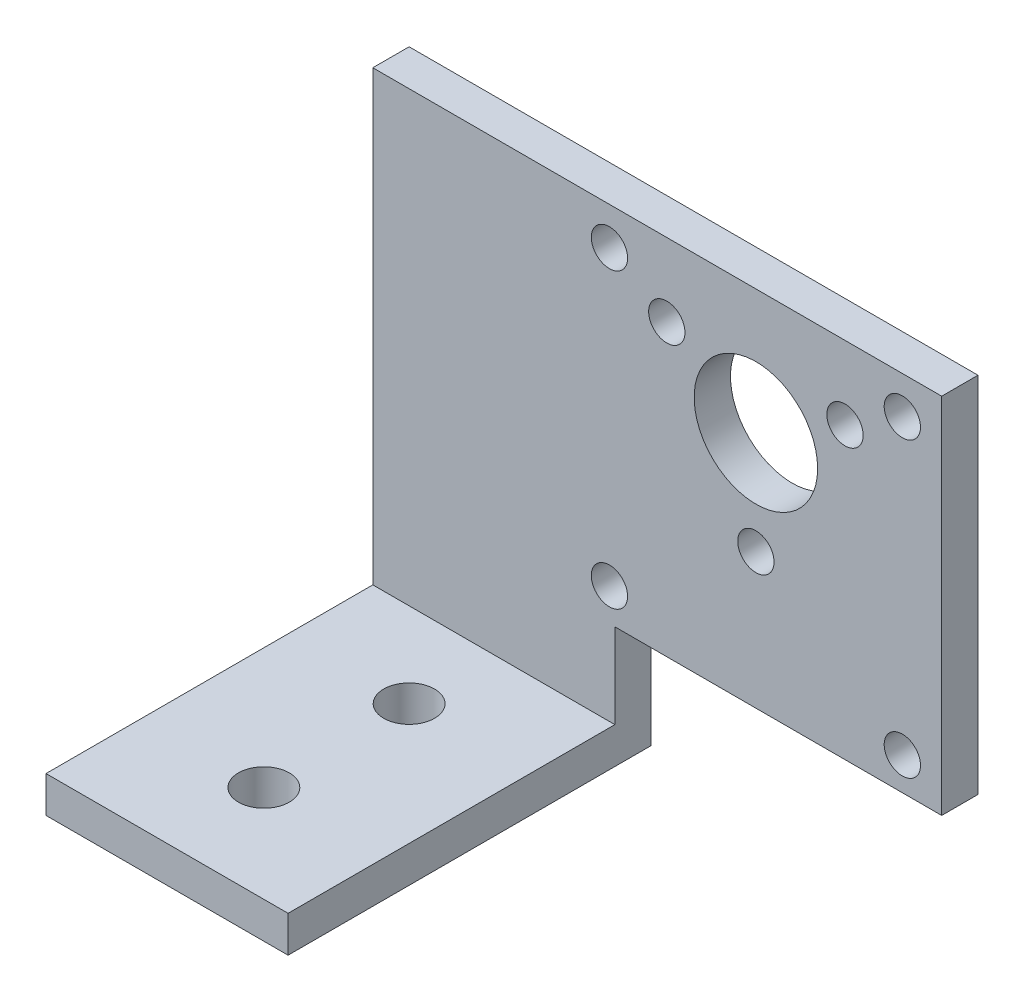
ISO-10303-21;
HEADER;
FILE_DESCRIPTION(('STEP AP214'),'2;1');
FILE_NAME('part.step','',(''),(''),'','','');
FILE_SCHEMA(('AUTOMOTIVE_DESIGN { 1 0 10303 214 1 1 1 1 }'));
ENDSEC;
DATA;
#1=APPLICATION_CONTEXT('core data for automotive mechanical design processes');
#2=APPLICATION_PROTOCOL_DEFINITION('international standard','automotive_design',2000,#1);
#3=PRODUCT_CONTEXT('',#1,'mechanical');
#4=PRODUCT('Part','Part','',(#3));
#5=PRODUCT_RELATED_PRODUCT_CATEGORY('part','',(#4));
#6=PRODUCT_DEFINITION_FORMATION('','',#4);
#7=PRODUCT_DEFINITION_CONTEXT('part definition',#1,'design');
#8=PRODUCT_DEFINITION('design','',#6,#7);
#9=PRODUCT_DEFINITION_SHAPE('','',#8);
#10=(LENGTH_UNIT() NAMED_UNIT(*) SI_UNIT(.MILLI.,.METRE.));
#11=(NAMED_UNIT(*) PLANE_ANGLE_UNIT() SI_UNIT($,.RADIAN.));
#12=(NAMED_UNIT(*) SI_UNIT($,.STERADIAN.) SOLID_ANGLE_UNIT());
#13=UNCERTAINTY_MEASURE_WITH_UNIT(LENGTH_MEASURE(1.E-05),#10,'distance_accuracy_value','');
#14=(GEOMETRIC_REPRESENTATION_CONTEXT(3) GLOBAL_UNCERTAINTY_ASSIGNED_CONTEXT((#13)) GLOBAL_UNIT_ASSIGNED_CONTEXT((#10,
#11,#12)) REPRESENTATION_CONTEXT('',''));
#15=CARTESIAN_POINT('',(0.,0.,0.));
#16=DIRECTION('',(0.,0.,1.));
#17=DIRECTION('',(1.,0.,0.));
#18=AXIS2_PLACEMENT_3D('',#15,#16,#17);
#19=CARTESIAN_POINT('',(-11.65,-19.7,3.));
#20=DIRECTION('',(0.,0.,-1.));
#21=DIRECTION('',(-1.,0.,0.));
#22=AXIS2_PLACEMENT_3D('',#19,#20,#21);
#23=PLANE('',#22);
#24=CARTESIAN_POINT('',(7.36121593216771,4.25000000000004,3.));
#25=DIRECTION('',(0.,0.,1.));
#26=DIRECTION('',(1.,0.,0.));
#27=AXIS2_PLACEMENT_3D('',#24,#25,#26);
#28=CIRCLE('',#27,1.5);
#29=CARTESIAN_POINT('',(8.86121593216771,4.25000000000004,3.));
#30=VERTEX_POINT('',#29);
#31=EDGE_CURVE('E131',#30,#30,#28,.T.);
#32=ORIENTED_EDGE('',*,*,#31,.F.);
#33=EDGE_LOOP('',(#32));
#34=FACE_BOUND('',#33,.T.);
#35=CARTESIAN_POINT('',(0.,-8.5,3.));
#36=DIRECTION('',(0.,0.,1.));
#37=DIRECTION('',(1.,0.,0.));
#38=AXIS2_PLACEMENT_3D('',#35,#36,#37);
#39=CIRCLE('',#38,1.5);
#40=CARTESIAN_POINT('',(1.5,-8.5,3.));
#41=VERTEX_POINT('',#40);
#42=EDGE_CURVE('E143',#41,#41,#39,.T.);
#43=ORIENTED_EDGE('',*,*,#42,.F.);
#44=EDGE_LOOP('',(#43));
#45=FACE_BOUND('',#44,.T.);
#46=CARTESIAN_POINT('',(12.1,-17.,3.));
#47=DIRECTION('',(0.,0.,1.));
#48=DIRECTION('',(1.,0.,0.));
#49=AXIS2_PLACEMENT_3D('',#46,#47,#48);
#50=CIRCLE('',#49,1.5);
#51=CARTESIAN_POINT('',(13.6,-17.,3.));
#52=VERTEX_POINT('',#51);
#53=EDGE_CURVE('E155',#52,#52,#50,.T.);
#54=ORIENTED_EDGE('',*,*,#53,.F.);
#55=EDGE_LOOP('',(#54));
#56=FACE_BOUND('',#55,.T.);
#57=CARTESIAN_POINT('',(-12.1,7.2,3.));
#58=DIRECTION('',(0.,0.,1.));
#59=DIRECTION('',(1.,0.,0.));
#60=AXIS2_PLACEMENT_3D('',#57,#58,#59);
#61=CIRCLE('',#60,1.5);
#62=CARTESIAN_POINT('',(-10.6,7.2,3.));
#63=VERTEX_POINT('',#62);
#64=EDGE_CURVE('E167',#63,#63,#61,.T.);
#65=ORIENTED_EDGE('',*,*,#64,.F.);
#66=EDGE_LOOP('',(#65));
#67=FACE_BOUND('',#66,.T.);
#68=CARTESIAN_POINT('',(0.,0.,3.));
#69=DIRECTION('',(0.,0.,1.));
#70=DIRECTION('',(1.,0.,0.));
#71=AXIS2_PLACEMENT_3D('',#68,#69,#70);
#72=CIRCLE('',#71,5.1);
#73=CARTESIAN_POINT('',(5.1,0.,3.));
#74=VERTEX_POINT('',#73);
#75=EDGE_CURVE('E173',#74,#74,#72,.T.);
#76=ORIENTED_EDGE('',*,*,#75,.F.);
#77=EDGE_LOOP('',(#76));
#78=FACE_BOUND('',#77,.T.);
#79=CARTESIAN_POINT('',(-12.1,-17.,3.));
#80=DIRECTION('',(0.,0.,1.));
#81=DIRECTION('',(1.,0.,0.));
#82=AXIS2_PLACEMENT_3D('',#79,#80,#81);
#83=CIRCLE('',#82,1.5);
#84=CARTESIAN_POINT('',(-10.6,-17.,3.));
#85=VERTEX_POINT('',#84);
#86=EDGE_CURVE('E161',#85,#85,#83,.T.);
#87=ORIENTED_EDGE('',*,*,#86,.F.);
#88=EDGE_LOOP('',(#87));
#89=FACE_BOUND('',#88,.T.);
#90=CARTESIAN_POINT('',(12.1,7.2,3.));
#91=DIRECTION('',(0.,0.,1.));
#92=DIRECTION('',(1.,0.,0.));
#93=AXIS2_PLACEMENT_3D('',#90,#91,#92);
#94=CIRCLE('',#93,1.5);
#95=CARTESIAN_POINT('',(13.6,7.2,3.));
#96=VERTEX_POINT('',#95);
#97=EDGE_CURVE('E149',#96,#96,#94,.T.);
#98=ORIENTED_EDGE('',*,*,#97,.F.);
#99=EDGE_LOOP('',(#98));
#100=FACE_BOUND('',#99,.T.);
#101=CARTESIAN_POINT('',(-7.36121593216771,4.25000000000003,3.));
#102=DIRECTION('',(0.,0.,1.));
#103=DIRECTION('',(1.,0.,0.));
#104=AXIS2_PLACEMENT_3D('',#101,#102,#103);
#105=CIRCLE('',#104,1.5);
#106=CARTESIAN_POINT('',(-5.86121593216771,4.25000000000003,3.));
#107=VERTEX_POINT('',#106);
#108=EDGE_CURVE('E137',#107,#107,#105,.T.);
#109=ORIENTED_EDGE('',*,*,#108,.F.);
#110=EDGE_LOOP('',(#109));
#111=FACE_BOUND('',#110,.T.);
#112=DIRECTION('',(-1.,0.,0.));
#113=VECTOR('',#112,1.);
#114=CARTESIAN_POINT('',(-11.65,-26.7,3.));
#115=LINE('',#114,#113);
#116=CARTESIAN_POINT('',(-11.65,-26.7,3.));
#117=VERTEX_POINT('',#116);
#118=CARTESIAN_POINT('',(-31.65,-26.7,3.));
#119=VERTEX_POINT('',#118);
#120=EDGE_CURVE('E43',#117,#119,#115,.T.);
#121=ORIENTED_EDGE('',*,*,#120,.F.);
#122=DIRECTION('',(0.,1.,0.));
#123=VECTOR('',#122,1.);
#124=CARTESIAN_POINT('',(-11.65,-29.7,3.));
#125=LINE('',#124,#123);
#126=CARTESIAN_POINT('',(-11.65,-19.7,3.));
#127=VERTEX_POINT('',#126);
#128=EDGE_CURVE('E189',#117,#127,#125,.T.);
#129=ORIENTED_EDGE('',*,*,#128,.T.);
#130=DIRECTION('',(1.,0.,0.));
#131=VECTOR('',#130,1.);
#132=CARTESIAN_POINT('',(-11.65,-19.7,3.));
#133=LINE('',#132,#131);
#134=CARTESIAN_POINT('',(15.35,-19.7,3.));
#135=VERTEX_POINT('',#134);
#136=EDGE_CURVE('E192',#127,#135,#133,.T.);
#137=ORIENTED_EDGE('',*,*,#136,.T.);
#138=DIRECTION('',(0.,1.,0.));
#139=VECTOR('',#138,1.);
#140=CARTESIAN_POINT('',(15.35,-19.7,3.));
#141=LINE('',#140,#139);
#142=CARTESIAN_POINT('',(15.35,10.3,3.));
#143=VERTEX_POINT('',#142);
#144=EDGE_CURVE('E208',#135,#143,#141,.T.);
#145=ORIENTED_EDGE('',*,*,#144,.T.);
#146=DIRECTION('',(-1.,0.,0.));
#147=VECTOR('',#146,1.);
#148=CARTESIAN_POINT('',(15.35,10.3,3.));
#149=LINE('',#148,#147);
#150=CARTESIAN_POINT('',(-31.65,10.3,3.));
#151=VERTEX_POINT('',#150);
#152=EDGE_CURVE('E49',#143,#151,#149,.T.);
#153=ORIENTED_EDGE('',*,*,#152,.T.);
#154=DIRECTION('',(0.,-1.,0.));
#155=VECTOR('',#154,1.);
#156=CARTESIAN_POINT('',(-31.65,10.3,3.));
#157=LINE('',#156,#155);
#158=EDGE_CURVE('E90',#151,#119,#157,.T.);
#159=ORIENTED_EDGE('',*,*,#158,.T.);
#160=EDGE_LOOP('',(#121,#129,#137,#145,#153,#159));
#161=FACE_BOUND('',#160,.T.);
#162=ADVANCED_FACE('F26',(#34,#45,#56,#67,#78,#89,#100,#111,#161),#23,.F.);
#163=CARTESIAN_POINT('',(-11.65,-19.7,0.));
#164=DIRECTION('',(0.,0.,-1.));
#165=DIRECTION('',(-1.,0.,0.));
#166=AXIS2_PLACEMENT_3D('',#163,#164,#165);
#167=PLANE('',#166);
#168=CARTESIAN_POINT('',(-7.36121593216771,4.25000000000003,0.));
#169=DIRECTION('',(0.,0.,1.));
#170=DIRECTION('',(1.,0.,0.));
#171=AXIS2_PLACEMENT_3D('',#168,#169,#170);
#172=CIRCLE('',#171,1.5);
#173=CARTESIAN_POINT('',(-5.86121593216771,4.25000000000003,0.));
#174=VERTEX_POINT('',#173);
#175=EDGE_CURVE('E134',#174,#174,#172,.T.);
#176=ORIENTED_EDGE('',*,*,#175,.T.);
#177=EDGE_LOOP('',(#176));
#178=FACE_BOUND('',#177,.T.);
#179=CARTESIAN_POINT('',(12.1,7.2,0.));
#180=DIRECTION('',(0.,0.,1.));
#181=DIRECTION('',(1.,0.,0.));
#182=AXIS2_PLACEMENT_3D('',#179,#180,#181);
#183=CIRCLE('',#182,1.5);
#184=CARTESIAN_POINT('',(13.6,7.2,0.));
#185=VERTEX_POINT('',#184);
#186=EDGE_CURVE('E146',#185,#185,#183,.T.);
#187=ORIENTED_EDGE('',*,*,#186,.T.);
#188=EDGE_LOOP('',(#187));
#189=FACE_BOUND('',#188,.T.);
#190=CARTESIAN_POINT('',(-12.1,-17.,0.));
#191=DIRECTION('',(0.,0.,1.));
#192=DIRECTION('',(1.,0.,0.));
#193=AXIS2_PLACEMENT_3D('',#190,#191,#192);
#194=CIRCLE('',#193,1.5);
#195=CARTESIAN_POINT('',(-10.6,-17.,0.));
#196=VERTEX_POINT('',#195);
#197=EDGE_CURVE('E158',#196,#196,#194,.T.);
#198=ORIENTED_EDGE('',*,*,#197,.T.);
#199=EDGE_LOOP('',(#198));
#200=FACE_BOUND('',#199,.T.);
#201=CARTESIAN_POINT('',(0.,0.,0.));
#202=DIRECTION('',(0.,0.,1.));
#203=DIRECTION('',(1.,0.,0.));
#204=AXIS2_PLACEMENT_3D('',#201,#202,#203);
#205=CIRCLE('',#204,5.1);
#206=CARTESIAN_POINT('',(5.1,0.,0.));
#207=VERTEX_POINT('',#206);
#208=EDGE_CURVE('E170',#207,#207,#205,.T.);
#209=ORIENTED_EDGE('',*,*,#208,.T.);
#210=EDGE_LOOP('',(#209));
#211=FACE_BOUND('',#210,.T.);
#212=DIRECTION('',(0.,1.,0.));
#213=VECTOR('',#212,1.);
#214=CARTESIAN_POINT('',(-11.65,-29.7,0.));
#215=LINE('',#214,#213);
#216=CARTESIAN_POINT('',(-11.65,-29.7,0.));
#217=VERTEX_POINT('',#216);
#218=CARTESIAN_POINT('',(-11.65,-19.7,0.));
#219=VERTEX_POINT('',#218);
#220=EDGE_CURVE('E176',#217,#219,#215,.T.);
#221=ORIENTED_EDGE('',*,*,#220,.F.);
#222=DIRECTION('',(1.,0.,0.));
#223=VECTOR('',#222,1.);
#224=CARTESIAN_POINT('',(-31.65,-29.7,0.));
#225=LINE('',#224,#223);
#226=CARTESIAN_POINT('',(-31.65,-29.7,0.));
#227=VERTEX_POINT('',#226);
#228=EDGE_CURVE('E187',#227,#217,#225,.T.);
#229=ORIENTED_EDGE('',*,*,#228,.F.);
#230=DIRECTION('',(0.,-1.,0.));
#231=VECTOR('',#230,1.);
#232=CARTESIAN_POINT('',(-31.65,10.3,0.));
#233=LINE('',#232,#231);
#234=CARTESIAN_POINT('',(-31.65,10.3,0.));
#235=VERTEX_POINT('',#234);
#236=EDGE_CURVE('E185',#235,#227,#233,.T.);
#237=ORIENTED_EDGE('',*,*,#236,.F.);
#238=DIRECTION('',(-1.,0.,0.));
#239=VECTOR('',#238,1.);
#240=CARTESIAN_POINT('',(15.35,10.3,0.));
#241=LINE('',#240,#239);
#242=CARTESIAN_POINT('',(15.35,10.3,0.));
#243=VERTEX_POINT('',#242);
#244=EDGE_CURVE('E183',#243,#235,#241,.T.);
#245=ORIENTED_EDGE('',*,*,#244,.F.);
#246=DIRECTION('',(0.,1.,0.));
#247=VECTOR('',#246,1.);
#248=CARTESIAN_POINT('',(15.35,-19.7,0.));
#249=LINE('',#248,#247);
#250=CARTESIAN_POINT('',(15.35,-19.7,0.));
#251=VERTEX_POINT('',#250);
#252=EDGE_CURVE('E181',#251,#243,#249,.T.);
#253=ORIENTED_EDGE('',*,*,#252,.F.);
#254=DIRECTION('',(1.,0.,0.));
#255=VECTOR('',#254,1.);
#256=CARTESIAN_POINT('',(-11.65,-19.7,0.));
#257=LINE('',#256,#255);
#258=EDGE_CURVE('E179',#219,#251,#257,.T.);
#259=ORIENTED_EDGE('',*,*,#258,.F.);
#260=EDGE_LOOP('',(#221,#229,#237,#245,#253,#259));
#261=FACE_BOUND('',#260,.T.);
#262=CARTESIAN_POINT('',(-12.1,7.2,0.));
#263=DIRECTION('',(0.,0.,1.));
#264=DIRECTION('',(1.,0.,0.));
#265=AXIS2_PLACEMENT_3D('',#262,#263,#264);
#266=CIRCLE('',#265,1.5);
#267=CARTESIAN_POINT('',(-10.6,7.2,0.));
#268=VERTEX_POINT('',#267);
#269=EDGE_CURVE('E164',#268,#268,#266,.T.);
#270=ORIENTED_EDGE('',*,*,#269,.T.);
#271=EDGE_LOOP('',(#270));
#272=FACE_BOUND('',#271,.T.);
#273=CARTESIAN_POINT('',(12.1,-17.,0.));
#274=DIRECTION('',(0.,0.,1.));
#275=DIRECTION('',(1.,0.,0.));
#276=AXIS2_PLACEMENT_3D('',#273,#274,#275);
#277=CIRCLE('',#276,1.5);
#278=CARTESIAN_POINT('',(13.6,-17.,0.));
#279=VERTEX_POINT('',#278);
#280=EDGE_CURVE('E152',#279,#279,#277,.T.);
#281=ORIENTED_EDGE('',*,*,#280,.T.);
#282=EDGE_LOOP('',(#281));
#283=FACE_BOUND('',#282,.T.);
#284=CARTESIAN_POINT('',(0.,-8.5,0.));
#285=DIRECTION('',(0.,0.,1.));
#286=DIRECTION('',(1.,0.,0.));
#287=AXIS2_PLACEMENT_3D('',#284,#285,#286);
#288=CIRCLE('',#287,1.5);
#289=CARTESIAN_POINT('',(1.5,-8.5,0.));
#290=VERTEX_POINT('',#289);
#291=EDGE_CURVE('E140',#290,#290,#288,.T.);
#292=ORIENTED_EDGE('',*,*,#291,.T.);
#293=EDGE_LOOP('',(#292));
#294=FACE_BOUND('',#293,.T.);
#295=CARTESIAN_POINT('',(7.36121593216771,4.25000000000004,0.));
#296=DIRECTION('',(0.,0.,1.));
#297=DIRECTION('',(1.,0.,0.));
#298=AXIS2_PLACEMENT_3D('',#295,#296,#297);
#299=CIRCLE('',#298,1.5);
#300=CARTESIAN_POINT('',(8.86121593216771,4.25000000000004,0.));
#301=VERTEX_POINT('',#300);
#302=EDGE_CURVE('E112',#301,#301,#299,.T.);
#303=ORIENTED_EDGE('',*,*,#302,.T.);
#304=EDGE_LOOP('',(#303));
#305=FACE_BOUND('',#304,.T.);
#306=ADVANCED_FACE('F226',(#178,#189,#200,#211,#261,#272,#283,#294,#305),#167,.T.);
#307=CARTESIAN_POINT('',(-11.65,-29.7,3.));
#308=DIRECTION('',(-1.,0.,0.));
#309=DIRECTION('',(0.,0.,1.));
#310=AXIS2_PLACEMENT_3D('',#307,#308,#309);
#311=PLANE('',#310);
#312=ORIENTED_EDGE('',*,*,#220,.T.);
#313=DIRECTION('',(0.,0.,-1.));
#314=VECTOR('',#313,1.);
#315=CARTESIAN_POINT('',(-11.65,-19.7,3.));
#316=LINE('',#315,#314);
#317=EDGE_CURVE('E11',#127,#219,#316,.T.);
#318=ORIENTED_EDGE('',*,*,#317,.F.);
#319=ORIENTED_EDGE('',*,*,#128,.F.);
#320=DIRECTION('',(0.,0.,-1.));
#321=VECTOR('',#320,1.);
#322=CARTESIAN_POINT('',(-11.65,-26.7,30.));
#323=LINE('',#322,#321);
#324=CARTESIAN_POINT('',(-11.65,-26.7,30.));
#325=VERTEX_POINT('',#324);
#326=EDGE_CURVE('E103',#325,#117,#323,.T.);
#327=ORIENTED_EDGE('',*,*,#326,.F.);
#328=DIRECTION('',(0.,1.,0.));
#329=VECTOR('',#328,1.);
#330=CARTESIAN_POINT('',(-11.65,-29.7,30.));
#331=LINE('',#330,#329);
#332=CARTESIAN_POINT('',(-11.65,-29.7,30.));
#333=VERTEX_POINT('',#332);
#334=EDGE_CURVE('E104',#333,#325,#331,.T.);
#335=ORIENTED_EDGE('',*,*,#334,.F.);
#336=DIRECTION('',(0.,0.,-1.));
#337=VECTOR('',#336,1.);
#338=CARTESIAN_POINT('',(-11.65,-29.7,3.));
#339=LINE('',#338,#337);
#340=EDGE_CURVE('E94',#333,#217,#339,.T.);
#341=ORIENTED_EDGE('',*,*,#340,.T.);
#342=EDGE_LOOP('',(#312,#318,#319,#327,#335,#341));
#343=FACE_BOUND('',#342,.T.);
#344=ADVANCED_FACE('F28',(#343),#311,.F.);
#345=CARTESIAN_POINT('',(-11.65,-19.7,3.));
#346=DIRECTION('',(0.,1.,0.));
#347=DIRECTION('',(-1.,0.,0.));
#348=AXIS2_PLACEMENT_3D('',#345,#346,#347);
#349=PLANE('',#348);
#350=ORIENTED_EDGE('',*,*,#258,.T.);
#351=DIRECTION('',(0.,0.,-1.));
#352=VECTOR('',#351,1.);
#353=CARTESIAN_POINT('',(15.35,-19.7,3.));
#354=LINE('',#353,#352);
#355=EDGE_CURVE('E35',#135,#251,#354,.T.);
#356=ORIENTED_EDGE('',*,*,#355,.F.);
#357=ORIENTED_EDGE('',*,*,#136,.F.);
#358=ORIENTED_EDGE('',*,*,#317,.T.);
#359=EDGE_LOOP('',(#350,#356,#357,#358));
#360=FACE_BOUND('',#359,.T.);
#361=ADVANCED_FACE('F215',(#360),#349,.F.);
#362=CARTESIAN_POINT('',(15.35,-19.7,3.));
#363=DIRECTION('',(-1.,0.,0.));
#364=DIRECTION('',(0.,0.,1.));
#365=AXIS2_PLACEMENT_3D('',#362,#363,#364);
#366=PLANE('',#365);
#367=ORIENTED_EDGE('',*,*,#252,.T.);
#368=DIRECTION('',(0.,0.,-1.));
#369=VECTOR('',#368,1.);
#370=CARTESIAN_POINT('',(15.35,10.3,3.));
#371=LINE('',#370,#369);
#372=EDGE_CURVE('E197',#143,#243,#371,.T.);
#373=ORIENTED_EDGE('',*,*,#372,.F.);
#374=ORIENTED_EDGE('',*,*,#144,.F.);
#375=ORIENTED_EDGE('',*,*,#355,.T.);
#376=EDGE_LOOP('',(#367,#373,#374,#375));
#377=FACE_BOUND('',#376,.T.);
#378=ADVANCED_FACE('F218',(#377),#366,.F.);
#379=CARTESIAN_POINT('',(15.35,10.3,3.));
#380=DIRECTION('',(0.,-1.,0.));
#381=DIRECTION('',(1.,0.,0.));
#382=AXIS2_PLACEMENT_3D('',#379,#380,#381);
#383=PLANE('',#382);
#384=ORIENTED_EDGE('',*,*,#244,.T.);
#385=DIRECTION('',(0.,0.,-1.));
#386=VECTOR('',#385,1.);
#387=CARTESIAN_POINT('',(-31.65,10.3,3.));
#388=LINE('',#387,#386);
#389=EDGE_CURVE('E200',#151,#235,#388,.T.);
#390=ORIENTED_EDGE('',*,*,#389,.F.);
#391=ORIENTED_EDGE('',*,*,#152,.F.);
#392=ORIENTED_EDGE('',*,*,#372,.T.);
#393=EDGE_LOOP('',(#384,#390,#391,#392));
#394=FACE_BOUND('',#393,.T.);
#395=ADVANCED_FACE('F221',(#394),#383,.F.);
#396=CARTESIAN_POINT('',(-31.65,10.3,3.));
#397=DIRECTION('',(1.,0.,0.));
#398=DIRECTION('',(0.,1.,0.));
#399=AXIS2_PLACEMENT_3D('',#396,#397,#398);
#400=PLANE('',#399);
#401=ORIENTED_EDGE('',*,*,#236,.T.);
#402=DIRECTION('',(0.,0.,-1.));
#403=VECTOR('',#402,1.);
#404=CARTESIAN_POINT('',(-31.65,-29.7,3.));
#405=LINE('',#404,#403);
#406=CARTESIAN_POINT('',(-31.65,-29.7,30.));
#407=VERTEX_POINT('',#406);
#408=EDGE_CURVE('E202',#407,#227,#405,.T.);
#409=ORIENTED_EDGE('',*,*,#408,.F.);
#410=DIRECTION('',(0.,-1.,0.));
#411=VECTOR('',#410,1.);
#412=CARTESIAN_POINT('',(-31.65,-29.7,30.));
#413=LINE('',#412,#411);
#414=CARTESIAN_POINT('',(-31.65,-26.7,30.));
#415=VERTEX_POINT('',#414);
#416=EDGE_CURVE('E109',#415,#407,#413,.T.);
#417=ORIENTED_EDGE('',*,*,#416,.F.);
#418=DIRECTION('',(0.,0.,-1.));
#419=VECTOR('',#418,1.);
#420=CARTESIAN_POINT('',(-31.65,-26.7,30.));
#421=LINE('',#420,#419);
#422=EDGE_CURVE('E100',#415,#119,#421,.T.);
#423=ORIENTED_EDGE('',*,*,#422,.T.);
#424=ORIENTED_EDGE('',*,*,#158,.F.);
#425=ORIENTED_EDGE('',*,*,#389,.T.);
#426=EDGE_LOOP('',(#401,#409,#417,#423,#424,#425));
#427=FACE_BOUND('',#426,.T.);
#428=ADVANCED_FACE('F107',(#427),#400,.F.);
#429=CARTESIAN_POINT('',(-31.65,-29.7,3.));
#430=DIRECTION('',(0.,1.,0.));
#431=DIRECTION('',(-1.,0.,0.));
#432=AXIS2_PLACEMENT_3D('',#429,#430,#431);
#433=PLANE('',#432);
#434=CARTESIAN_POINT('',(-21.65,-29.7,22.));
#435=DIRECTION('',(0.,1.,0.));
#436=DIRECTION('',(0.,0.,1.));
#437=AXIS2_PLACEMENT_3D('',#434,#435,#436);
#438=CIRCLE('',#437,2.1);
#439=CARTESIAN_POINT('',(-21.65,-29.7,24.1));
#440=VERTEX_POINT('',#439);
#441=EDGE_CURVE('E315',#440,#440,#438,.T.);
#442=ORIENTED_EDGE('',*,*,#441,.T.);
#443=EDGE_LOOP('',(#442));
#444=FACE_BOUND('',#443,.T.);
#445=CARTESIAN_POINT('',(-21.65,-29.7,10.));
#446=DIRECTION('',(0.,1.,0.));
#447=DIRECTION('',(0.,0.,1.));
#448=AXIS2_PLACEMENT_3D('',#445,#446,#447);
#449=CIRCLE('',#448,2.1);
#450=CARTESIAN_POINT('',(-21.65,-29.7,12.1));
#451=VERTEX_POINT('',#450);
#452=EDGE_CURVE('E105',#451,#451,#449,.T.);
#453=ORIENTED_EDGE('',*,*,#452,.T.);
#454=EDGE_LOOP('',(#453));
#455=FACE_BOUND('',#454,.T.);
#456=ORIENTED_EDGE('',*,*,#228,.T.);
#457=ORIENTED_EDGE('',*,*,#340,.F.);
#458=DIRECTION('',(1.,0.,0.));
#459=VECTOR('',#458,1.);
#460=CARTESIAN_POINT('',(-11.65,-29.7,30.));
#461=LINE('',#460,#459);
#462=EDGE_CURVE('E110',#407,#333,#461,.T.);
#463=ORIENTED_EDGE('',*,*,#462,.F.);
#464=ORIENTED_EDGE('',*,*,#408,.T.);
#465=EDGE_LOOP('',(#456,#457,#463,#464));
#466=FACE_BOUND('',#465,.T.);
#467=ADVANCED_FACE('F229',(#444,#455,#466),#433,.F.);
#468=CARTESIAN_POINT('',(0.,0.,3.));
#469=DIRECTION('',(0.,0.,-1.));
#470=DIRECTION('',(-1.,0.,0.));
#471=AXIS2_PLACEMENT_3D('',#468,#469,#470);
#472=CYLINDRICAL_SURFACE('',#471,5.1);
#473=ORIENTED_EDGE('',*,*,#75,.T.);
#474=EDGE_LOOP('',(#473));
#475=FACE_BOUND('',#474,.T.);
#476=ORIENTED_EDGE('',*,*,#208,.F.);
#477=EDGE_LOOP('',(#476));
#478=FACE_BOUND('',#477,.T.);
#479=ADVANCED_FACE('F265',(#475,#478),#472,.F.);
#480=CARTESIAN_POINT('',(-12.1,7.2,3.));
#481=DIRECTION('',(0.,0.,-1.));
#482=DIRECTION('',(-1.,0.,0.));
#483=AXIS2_PLACEMENT_3D('',#480,#481,#482);
#484=CYLINDRICAL_SURFACE('',#483,1.5);
#485=ORIENTED_EDGE('',*,*,#64,.T.);
#486=EDGE_LOOP('',(#485));
#487=FACE_BOUND('',#486,.T.);
#488=ORIENTED_EDGE('',*,*,#269,.F.);
#489=EDGE_LOOP('',(#488));
#490=FACE_BOUND('',#489,.T.);
#491=ADVANCED_FACE('F333',(#487,#490),#484,.F.);
#492=CARTESIAN_POINT('',(-12.1,-17.,3.));
#493=DIRECTION('',(0.,0.,-1.));
#494=DIRECTION('',(-1.,0.,0.));
#495=AXIS2_PLACEMENT_3D('',#492,#493,#494);
#496=CYLINDRICAL_SURFACE('',#495,1.5);
#497=ORIENTED_EDGE('',*,*,#86,.T.);
#498=EDGE_LOOP('',(#497));
#499=FACE_BOUND('',#498,.T.);
#500=ORIENTED_EDGE('',*,*,#197,.F.);
#501=EDGE_LOOP('',(#500));
#502=FACE_BOUND('',#501,.T.);
#503=ADVANCED_FACE('F340',(#499,#502),#496,.F.);
#504=CARTESIAN_POINT('',(12.1,-17.,3.));
#505=DIRECTION('',(0.,0.,-1.));
#506=DIRECTION('',(-1.,0.,0.));
#507=AXIS2_PLACEMENT_3D('',#504,#505,#506);
#508=CYLINDRICAL_SURFACE('',#507,1.5);
#509=ORIENTED_EDGE('',*,*,#53,.T.);
#510=EDGE_LOOP('',(#509));
#511=FACE_BOUND('',#510,.T.);
#512=ORIENTED_EDGE('',*,*,#280,.F.);
#513=EDGE_LOOP('',(#512));
#514=FACE_BOUND('',#513,.T.);
#515=ADVANCED_FACE('F348',(#511,#514),#508,.F.);
#516=CARTESIAN_POINT('',(12.1,7.2,3.));
#517=DIRECTION('',(0.,0.,-1.));
#518=DIRECTION('',(-1.,0.,0.));
#519=AXIS2_PLACEMENT_3D('',#516,#517,#518);
#520=CYLINDRICAL_SURFACE('',#519,1.5);
#521=ORIENTED_EDGE('',*,*,#97,.T.);
#522=EDGE_LOOP('',(#521));
#523=FACE_BOUND('',#522,.T.);
#524=ORIENTED_EDGE('',*,*,#186,.F.);
#525=EDGE_LOOP('',(#524));
#526=FACE_BOUND('',#525,.T.);
#527=ADVANCED_FACE('F356',(#523,#526),#520,.F.);
#528=CARTESIAN_POINT('',(0.,-8.5,3.));
#529=DIRECTION('',(0.,0.,-1.));
#530=DIRECTION('',(-1.,0.,0.));
#531=AXIS2_PLACEMENT_3D('',#528,#529,#530);
#532=CYLINDRICAL_SURFACE('',#531,1.5);
#533=ORIENTED_EDGE('',*,*,#42,.T.);
#534=EDGE_LOOP('',(#533));
#535=FACE_BOUND('',#534,.T.);
#536=ORIENTED_EDGE('',*,*,#291,.F.);
#537=EDGE_LOOP('',(#536));
#538=FACE_BOUND('',#537,.T.);
#539=ADVANCED_FACE('F364',(#535,#538),#532,.F.);
#540=CARTESIAN_POINT('',(-7.36121593216771,4.25000000000003,3.));
#541=DIRECTION('',(0.,0.,-1.));
#542=DIRECTION('',(-1.,0.,0.));
#543=AXIS2_PLACEMENT_3D('',#540,#541,#542);
#544=CYLINDRICAL_SURFACE('',#543,1.5);
#545=ORIENTED_EDGE('',*,*,#108,.T.);
#546=EDGE_LOOP('',(#545));
#547=FACE_BOUND('',#546,.T.);
#548=ORIENTED_EDGE('',*,*,#175,.F.);
#549=EDGE_LOOP('',(#548));
#550=FACE_BOUND('',#549,.T.);
#551=ADVANCED_FACE('F372',(#547,#550),#544,.F.);
#552=CARTESIAN_POINT('',(7.36121593216771,4.25000000000004,3.));
#553=DIRECTION('',(0.,0.,-1.));
#554=DIRECTION('',(-1.,0.,0.));
#555=AXIS2_PLACEMENT_3D('',#552,#553,#554);
#556=CYLINDRICAL_SURFACE('',#555,1.5);
#557=ORIENTED_EDGE('',*,*,#31,.T.);
#558=EDGE_LOOP('',(#557));
#559=FACE_BOUND('',#558,.T.);
#560=ORIENTED_EDGE('',*,*,#302,.F.);
#561=EDGE_LOOP('',(#560));
#562=FACE_BOUND('',#561,.T.);
#563=ADVANCED_FACE('F247',(#559,#562),#556,.F.);
#564=CARTESIAN_POINT('',(-11.65,-26.7,30.));
#565=DIRECTION('',(0.,-1.,0.));
#566=DIRECTION('',(0.,0.,-1.));
#567=AXIS2_PLACEMENT_3D('',#564,#565,#566);
#568=PLANE('',#567);
#569=CARTESIAN_POINT('',(-21.65,-26.7,22.));
#570=DIRECTION('',(0.,1.,0.));
#571=DIRECTION('',(0.,0.,1.));
#572=AXIS2_PLACEMENT_3D('',#569,#570,#571);
#573=CIRCLE('',#572,2.1);
#574=CARTESIAN_POINT('',(-21.65,-26.7,24.1));
#575=VERTEX_POINT('',#574);
#576=EDGE_CURVE('E318',#575,#575,#573,.T.);
#577=ORIENTED_EDGE('',*,*,#576,.F.);
#578=EDGE_LOOP('',(#577));
#579=FACE_BOUND('',#578,.T.);
#580=CARTESIAN_POINT('',(-21.65,-26.7,10.));
#581=DIRECTION('',(0.,1.,0.));
#582=DIRECTION('',(0.,0.,1.));
#583=AXIS2_PLACEMENT_3D('',#580,#581,#582);
#584=CIRCLE('',#583,2.1);
#585=CARTESIAN_POINT('',(-21.65,-26.7,12.1));
#586=VERTEX_POINT('',#585);
#587=EDGE_CURVE('E320',#586,#586,#584,.T.);
#588=ORIENTED_EDGE('',*,*,#587,.F.);
#589=EDGE_LOOP('',(#588));
#590=FACE_BOUND('',#589,.T.);
#591=ORIENTED_EDGE('',*,*,#120,.T.);
#592=ORIENTED_EDGE('',*,*,#422,.F.);
#593=DIRECTION('',(-1.,0.,0.));
#594=VECTOR('',#593,1.);
#595=CARTESIAN_POINT('',(-11.65,-26.7,30.));
#596=LINE('',#595,#594);
#597=EDGE_CURVE('E126',#325,#415,#596,.T.);
#598=ORIENTED_EDGE('',*,*,#597,.F.);
#599=ORIENTED_EDGE('',*,*,#326,.T.);
#600=EDGE_LOOP('',(#591,#592,#598,#599));
#601=FACE_BOUND('',#600,.T.);
#602=ADVANCED_FACE('F99',(#579,#590,#601),#568,.F.);
#603=CARTESIAN_POINT('',(-11.65,-26.7,30.));
#604=DIRECTION('',(0.,0.,1.));
#605=DIRECTION('',(1.,0.,0.));
#606=AXIS2_PLACEMENT_3D('',#603,#604,#605);
#607=PLANE('',#606);
#608=ORIENTED_EDGE('',*,*,#334,.T.);
#609=ORIENTED_EDGE('',*,*,#597,.T.);
#610=ORIENTED_EDGE('',*,*,#416,.T.);
#611=ORIENTED_EDGE('',*,*,#462,.T.);
#612=EDGE_LOOP('',(#608,#609,#610,#611));
#613=FACE_BOUND('',#612,.T.);
#614=ADVANCED_FACE('F234',(#613),#607,.T.);
#615=CARTESIAN_POINT('',(-21.65,-29.7,10.));
#616=DIRECTION('',(0.,1.,0.));
#617=DIRECTION('',(0.,0.,1.));
#618=AXIS2_PLACEMENT_3D('',#615,#616,#617);
#619=CYLINDRICAL_SURFACE('',#618,2.1);
#620=ORIENTED_EDGE('',*,*,#452,.F.);
#621=EDGE_LOOP('',(#620));
#622=FACE_BOUND('',#621,.T.);
#623=ORIENTED_EDGE('',*,*,#587,.T.);
#624=EDGE_LOOP('',(#623));
#625=FACE_BOUND('',#624,.T.);
#626=ADVANCED_FACE('F236',(#622,#625),#619,.F.);
#627=CARTESIAN_POINT('',(-21.65,-29.7,22.));
#628=DIRECTION('',(0.,1.,0.));
#629=DIRECTION('',(0.,0.,1.));
#630=AXIS2_PLACEMENT_3D('',#627,#628,#629);
#631=CYLINDRICAL_SURFACE('',#630,2.1);
#632=ORIENTED_EDGE('',*,*,#441,.F.);
#633=EDGE_LOOP('',(#632));
#634=FACE_BOUND('',#633,.T.);
#635=ORIENTED_EDGE('',*,*,#576,.T.);
#636=EDGE_LOOP('',(#635));
#637=FACE_BOUND('',#636,.T.);
#638=ADVANCED_FACE('F243',(#634,#637),#631,.F.);
#639=CLOSED_SHELL('',(#162,#306,#344,#361,#378,#395,#428,#467,#479,#491,#503,#515,#527,#539,
#551,#563,#602,#614,#626,#638));
#640=MANIFOLD_SOLID_BREP('B2',#639);
#641=ADVANCED_BREP_SHAPE_REPRESENTATION('',(#18,#640),#14);
#642=SHAPE_DEFINITION_REPRESENTATION(#9,#641);
ENDSEC;
END-ISO-10303-21;
